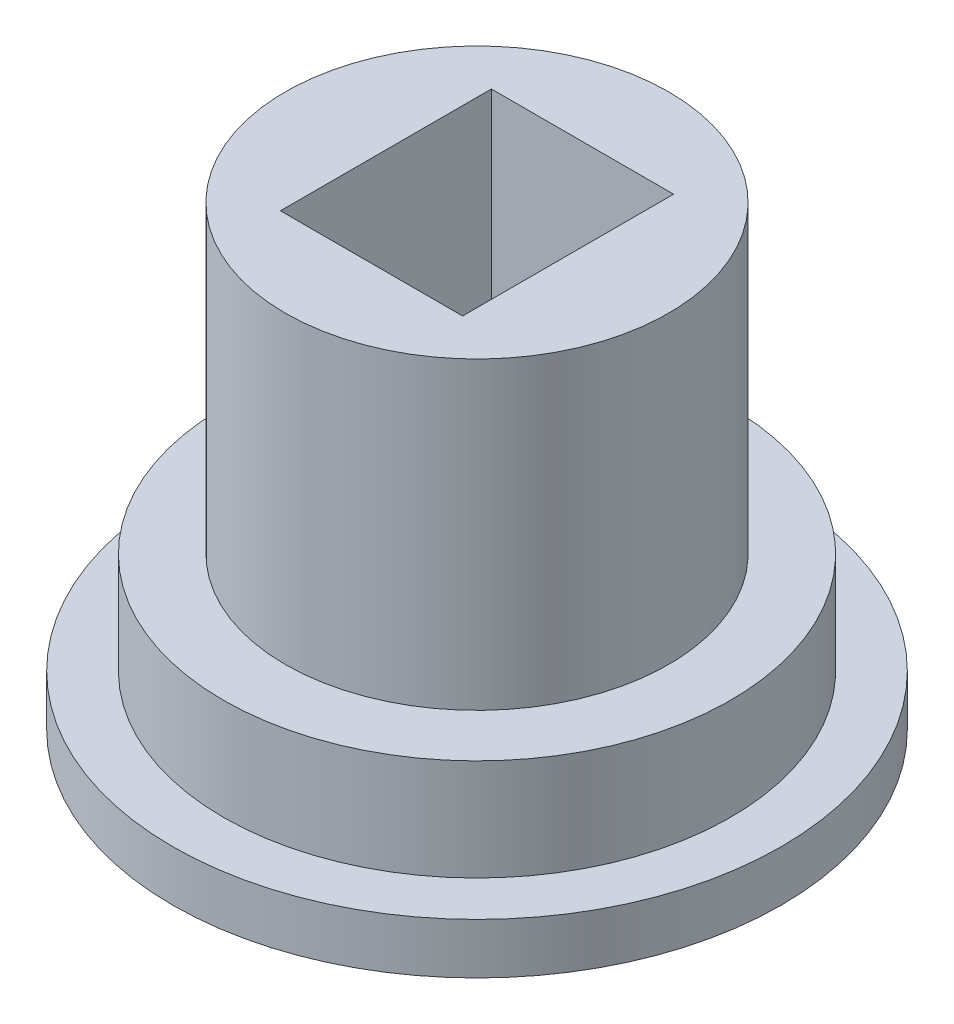
ISO-10303-21;
HEADER;
FILE_DESCRIPTION(('STEP AP214'),'2;1');
FILE_NAME('part.step','',(''),(''),'','','');
FILE_SCHEMA(('AUTOMOTIVE_DESIGN { 1 0 10303 214 1 1 1 1 }'));
ENDSEC;
DATA;
#1=APPLICATION_CONTEXT('core data for automotive mechanical design processes');
#2=APPLICATION_PROTOCOL_DEFINITION('international standard','automotive_design',2000,#1);
#3=PRODUCT_CONTEXT('',#1,'mechanical');
#4=PRODUCT('Part','Part','',(#3));
#5=PRODUCT_RELATED_PRODUCT_CATEGORY('part','',(#4));
#6=PRODUCT_DEFINITION_FORMATION('','',#4);
#7=PRODUCT_DEFINITION_CONTEXT('part definition',#1,'design');
#8=PRODUCT_DEFINITION('design','',#6,#7);
#9=PRODUCT_DEFINITION_SHAPE('','',#8);
#10=(LENGTH_UNIT() NAMED_UNIT(*) SI_UNIT(.MILLI.,.METRE.));
#11=(NAMED_UNIT(*) PLANE_ANGLE_UNIT() SI_UNIT($,.RADIAN.));
#12=(NAMED_UNIT(*) SI_UNIT($,.STERADIAN.) SOLID_ANGLE_UNIT());
#13=UNCERTAINTY_MEASURE_WITH_UNIT(LENGTH_MEASURE(1.E-05),#10,'distance_accuracy_value','');
#14=(GEOMETRIC_REPRESENTATION_CONTEXT(3) GLOBAL_UNCERTAINTY_ASSIGNED_CONTEXT((#13)) GLOBAL_UNIT_ASSIGNED_CONTEXT((#10,
#11,#12)) REPRESENTATION_CONTEXT('',''));
#15=CARTESIAN_POINT('',(0.,0.,0.));
#16=DIRECTION('',(0.,0.,1.));
#17=DIRECTION('',(1.,0.,0.));
#18=AXIS2_PLACEMENT_3D('',#15,#16,#17);
#19=CARTESIAN_POINT('',(0.,2.54,0.));
#20=DIRECTION('',(0.,-1.,0.));
#21=DIRECTION('',(0.,0.,-1.));
#22=AXIS2_PLACEMENT_3D('',#19,#20,#21);
#23=CYLINDRICAL_SURFACE('',#22,6.35);
#24=CARTESIAN_POINT('',(0.,2.54,0.));
#25=DIRECTION('',(0.,1.,0.));
#26=DIRECTION('',(0.,0.,1.));
#27=AXIS2_PLACEMENT_3D('',#24,#25,#26);
#28=CIRCLE('',#27,6.35);
#29=CARTESIAN_POINT('',(0.,2.54,6.35));
#30=VERTEX_POINT('',#29);
#31=EDGE_CURVE('E44',#30,#30,#28,.T.);
#32=ORIENTED_EDGE('',*,*,#31,.F.);
#33=EDGE_LOOP('',(#32));
#34=FACE_BOUND('',#33,.T.);
#35=CARTESIAN_POINT('',(0.,0.,0.));
#36=DIRECTION('',(0.,1.,0.));
#37=DIRECTION('',(0.,0.,1.));
#38=AXIS2_PLACEMENT_3D('',#35,#36,#37);
#39=CIRCLE('',#38,6.35);
#40=CARTESIAN_POINT('',(0.,0.,6.35));
#41=VERTEX_POINT('',#40);
#42=EDGE_CURVE('E39',#41,#41,#39,.T.);
#43=ORIENTED_EDGE('',*,*,#42,.T.);
#44=EDGE_LOOP('',(#43));
#45=FACE_BOUND('',#44,.T.);
#46=ADVANCED_FACE('F36',(#34,#45),#23,.T.);
#47=CARTESIAN_POINT('',(0.,2.54,0.));
#48=DIRECTION('',(0.,1.,0.));
#49=DIRECTION('',(0.,0.,1.));
#50=AXIS2_PLACEMENT_3D('',#47,#48,#49);
#51=PLANE('',#50);
#52=CARTESIAN_POINT('',(0.,2.54,0.));
#53=DIRECTION('',(0.,1.,0.));
#54=DIRECTION('',(0.,0.,1.));
#55=AXIS2_PLACEMENT_3D('',#52,#53,#54);
#56=CIRCLE('',#55,4.8006);
#57=CARTESIAN_POINT('',(0.,2.54,4.8006));
#58=VERTEX_POINT('',#57);
#59=EDGE_CURVE('E11',#58,#58,#56,.T.);
#60=ORIENTED_EDGE('',*,*,#59,.F.);
#61=EDGE_LOOP('',(#60));
#62=FACE_BOUND('',#61,.T.);
#63=ORIENTED_EDGE('',*,*,#31,.T.);
#64=EDGE_LOOP('',(#63));
#65=FACE_BOUND('',#64,.T.);
#66=ADVANCED_FACE('F121',(#62,#65),#51,.T.);
#67=CARTESIAN_POINT('',(0.,10.16,0.));
#68=DIRECTION('',(0.,-1.,0.));
#69=DIRECTION('',(0.,0.,-1.));
#70=AXIS2_PLACEMENT_3D('',#67,#68,#69);
#71=CYLINDRICAL_SURFACE('',#70,4.8006);
#72=CARTESIAN_POINT('',(0.,10.16,0.));
#73=DIRECTION('',(0.,1.,0.));
#74=DIRECTION('',(0.,0.,1.));
#75=AXIS2_PLACEMENT_3D('',#72,#73,#74);
#76=CIRCLE('',#75,4.8006);
#77=CARTESIAN_POINT('',(0.,10.16,4.8006));
#78=VERTEX_POINT('',#77);
#79=EDGE_CURVE('E114',#78,#78,#76,.T.);
#80=ORIENTED_EDGE('',*,*,#79,.F.);
#81=EDGE_LOOP('',(#80));
#82=FACE_BOUND('',#81,.T.);
#83=ORIENTED_EDGE('',*,*,#59,.T.);
#84=EDGE_LOOP('',(#83));
#85=FACE_BOUND('',#84,.T.);
#86=ADVANCED_FACE('F193',(#82,#85),#71,.T.);
#87=CARTESIAN_POINT('',(0.,10.16,0.));
#88=DIRECTION('',(0.,1.,0.));
#89=DIRECTION('',(0.,0.,1.));
#90=AXIS2_PLACEMENT_3D('',#87,#88,#89);
#91=PLANE('',#90);
#92=DIRECTION('',(0.,0.,-1.));
#93=VECTOR('',#92,1.);
#94=CARTESIAN_POINT('',(2.28138181818181,10.16,2.6416));
#95=LINE('',#94,#93);
#96=CARTESIAN_POINT('',(2.28138181818181,10.16,2.6416));
#97=VERTEX_POINT('',#96);
#98=CARTESIAN_POINT('',(2.28138181818181,10.16,-2.6416));
#99=VERTEX_POINT('',#98);
#100=EDGE_CURVE('E52',#97,#99,#95,.T.);
#101=ORIENTED_EDGE('',*,*,#100,.F.);
#102=DIRECTION('',(1.,0.,0.));
#103=VECTOR('',#102,1.);
#104=CARTESIAN_POINT('',(-2.28138181818181,10.16,2.6416));
#105=LINE('',#104,#103);
#106=CARTESIAN_POINT('',(-2.28138181818181,10.16,2.6416));
#107=VERTEX_POINT('',#106);
#108=EDGE_CURVE('E103',#107,#97,#105,.T.);
#109=ORIENTED_EDGE('',*,*,#108,.F.);
#110=DIRECTION('',(0.,0.,1.));
#111=VECTOR('',#110,1.);
#112=CARTESIAN_POINT('',(-2.28138181818181,10.16,2.6416));
#113=LINE('',#112,#111);
#114=CARTESIAN_POINT('',(-2.28138181818181,10.16,-2.6416));
#115=VERTEX_POINT('',#114);
#116=EDGE_CURVE('E110',#115,#107,#113,.T.);
#117=ORIENTED_EDGE('',*,*,#116,.F.);
#118=DIRECTION('',(-1.,0.,0.));
#119=VECTOR('',#118,1.);
#120=CARTESIAN_POINT('',(-2.28138181818181,10.16,-2.6416));
#121=LINE('',#120,#119);
#122=EDGE_CURVE('E87',#99,#115,#121,.T.);
#123=ORIENTED_EDGE('',*,*,#122,.F.);
#124=EDGE_LOOP('',(#101,#109,#117,#123));
#125=FACE_BOUND('',#124,.T.);
#126=ORIENTED_EDGE('',*,*,#79,.T.);
#127=EDGE_LOOP('',(#126));
#128=FACE_BOUND('',#127,.T.);
#129=ADVANCED_FACE('F190',(#125,#128),#91,.T.);
#130=CARTESIAN_POINT('',(2.28138181818181,2.54,2.6416));
#131=DIRECTION('',(1.,0.,0.));
#132=DIRECTION('',(0.,0.,-1.));
#133=AXIS2_PLACEMENT_3D('',#130,#131,#132);
#134=PLANE('',#133);
#135=ORIENTED_EDGE('',*,*,#100,.T.);
#136=DIRECTION('',(0.,1.,0.));
#137=VECTOR('',#136,1.);
#138=CARTESIAN_POINT('',(2.28138181818181,2.54,-2.6416));
#139=LINE('',#138,#137);
#140=CARTESIAN_POINT('',(2.28138181818181,2.54,-2.6416));
#141=VERTEX_POINT('',#140);
#142=EDGE_CURVE('E75',#141,#99,#139,.T.);
#143=ORIENTED_EDGE('',*,*,#142,.F.);
#144=DIRECTION('',(0.,0.,-1.));
#145=VECTOR('',#144,1.);
#146=CARTESIAN_POINT('',(2.28138181818181,2.54,2.6416));
#147=LINE('',#146,#145);
#148=CARTESIAN_POINT('',(2.28138181818181,2.54,2.6416));
#149=VERTEX_POINT('',#148);
#150=EDGE_CURVE('E101',#149,#141,#147,.T.);
#151=ORIENTED_EDGE('',*,*,#150,.F.);
#152=DIRECTION('',(0.,1.,0.));
#153=VECTOR('',#152,1.);
#154=CARTESIAN_POINT('',(2.28138181818181,2.54,2.6416));
#155=LINE('',#154,#153);
#156=EDGE_CURVE('E60',#149,#97,#155,.T.);
#157=ORIENTED_EDGE('',*,*,#156,.T.);
#158=EDGE_LOOP('',(#135,#143,#151,#157));
#159=FACE_BOUND('',#158,.T.);
#160=ADVANCED_FACE('F183',(#159),#134,.F.);
#161=CARTESIAN_POINT('',(-2.28138181818181,2.54,2.6416));
#162=DIRECTION('',(0.,0.,1.));
#163=DIRECTION('',(1.,0.,0.));
#164=AXIS2_PLACEMENT_3D('',#161,#162,#163);
#165=PLANE('',#164);
#166=ORIENTED_EDGE('',*,*,#108,.T.);
#167=ORIENTED_EDGE('',*,*,#156,.F.);
#168=DIRECTION('',(1.,0.,0.));
#169=VECTOR('',#168,1.);
#170=CARTESIAN_POINT('',(-2.28138181818181,2.54,2.6416));
#171=LINE('',#170,#169);
#172=CARTESIAN_POINT('',(-2.28138181818181,2.54,2.6416));
#173=VERTEX_POINT('',#172);
#174=EDGE_CURVE('E98',#173,#149,#171,.T.);
#175=ORIENTED_EDGE('',*,*,#174,.F.);
#176=DIRECTION('',(0.,1.,0.));
#177=VECTOR('',#176,1.);
#178=CARTESIAN_POINT('',(-2.28138181818181,2.54,2.6416));
#179=LINE('',#178,#177);
#180=EDGE_CURVE('E91',#173,#107,#179,.T.);
#181=ORIENTED_EDGE('',*,*,#180,.T.);
#182=EDGE_LOOP('',(#166,#167,#175,#181));
#183=FACE_BOUND('',#182,.T.);
#184=ADVANCED_FACE('F180',(#183),#165,.F.);
#185=CARTESIAN_POINT('',(-2.28138181818181,2.54,2.6416));
#186=DIRECTION('',(-1.,0.,0.));
#187=DIRECTION('',(0.,0.,1.));
#188=AXIS2_PLACEMENT_3D('',#185,#186,#187);
#189=PLANE('',#188);
#190=ORIENTED_EDGE('',*,*,#116,.T.);
#191=ORIENTED_EDGE('',*,*,#180,.F.);
#192=DIRECTION('',(0.,0.,1.));
#193=VECTOR('',#192,1.);
#194=CARTESIAN_POINT('',(-2.28138181818181,2.54,2.6416));
#195=LINE('',#194,#193);
#196=CARTESIAN_POINT('',(-2.28138181818181,2.54,-2.6416));
#197=VERTEX_POINT('',#196);
#198=EDGE_CURVE('E94',#197,#173,#195,.T.);
#199=ORIENTED_EDGE('',*,*,#198,.F.);
#200=DIRECTION('',(0.,1.,0.));
#201=VECTOR('',#200,1.);
#202=CARTESIAN_POINT('',(-2.28138181818181,2.54,-2.6416));
#203=LINE('',#202,#201);
#204=EDGE_CURVE('E80',#197,#115,#203,.T.);
#205=ORIENTED_EDGE('',*,*,#204,.T.);
#206=EDGE_LOOP('',(#190,#191,#199,#205));
#207=FACE_BOUND('',#206,.T.);
#208=ADVANCED_FACE('F95',(#207),#189,.F.);
#209=CARTESIAN_POINT('',(-2.28138181818181,2.54,-2.6416));
#210=DIRECTION('',(0.,0.,-1.));
#211=DIRECTION('',(-1.,0.,0.));
#212=AXIS2_PLACEMENT_3D('',#209,#210,#211);
#213=PLANE('',#212);
#214=ORIENTED_EDGE('',*,*,#122,.T.);
#215=ORIENTED_EDGE('',*,*,#204,.F.);
#216=DIRECTION('',(-1.,0.,0.));
#217=VECTOR('',#216,1.);
#218=CARTESIAN_POINT('',(-2.28138181818181,2.54,-2.6416));
#219=LINE('',#218,#217);
#220=EDGE_CURVE('E84',#141,#197,#219,.T.);
#221=ORIENTED_EDGE('',*,*,#220,.F.);
#222=ORIENTED_EDGE('',*,*,#142,.T.);
#223=EDGE_LOOP('',(#214,#215,#221,#222));
#224=FACE_BOUND('',#223,.T.);
#225=ADVANCED_FACE('F82',(#224),#213,.F.);
#226=CARTESIAN_POINT('',(0.,2.54,0.));
#227=DIRECTION('',(0.,-1.,0.));
#228=DIRECTION('',(0.,0.,-1.));
#229=AXIS2_PLACEMENT_3D('',#226,#227,#228);
#230=PLANE('',#229);
#231=CARTESIAN_POINT('',(0.,2.54,-1.27));
#232=DIRECTION('',(0.,1.,0.));
#233=DIRECTION('',(0.,0.,1.));
#234=AXIS2_PLACEMENT_3D('',#231,#232,#233);
#235=CIRCLE('',#234,0.762);
#236=CARTESIAN_POINT('',(0.,2.54,-0.508));
#237=VERTEX_POINT('',#236);
#238=EDGE_CURVE('E143',#237,#237,#235,.T.);
#239=ORIENTED_EDGE('',*,*,#238,.F.);
#240=EDGE_LOOP('',(#239));
#241=FACE_BOUND('',#240,.T.);
#242=CARTESIAN_POINT('',(0.,2.54,1.27));
#243=DIRECTION('',(0.,1.,0.));
#244=DIRECTION('',(0.,0.,1.));
#245=AXIS2_PLACEMENT_3D('',#242,#243,#244);
#246=CIRCLE('',#245,0.762);
#247=CARTESIAN_POINT('',(0.,2.54,2.032));
#248=VERTEX_POINT('',#247);
#249=EDGE_CURVE('E137',#248,#248,#246,.T.);
#250=ORIENTED_EDGE('',*,*,#249,.F.);
#251=EDGE_LOOP('',(#250));
#252=FACE_BOUND('',#251,.T.);
#253=ORIENTED_EDGE('',*,*,#150,.T.);
#254=ORIENTED_EDGE('',*,*,#220,.T.);
#255=ORIENTED_EDGE('',*,*,#198,.T.);
#256=ORIENTED_EDGE('',*,*,#174,.T.);
#257=EDGE_LOOP('',(#253,#254,#255,#256));
#258=FACE_BOUND('',#257,.T.);
#259=ADVANCED_FACE('F100',(#241,#252,#258),#230,.F.);
#260=CARTESIAN_POINT('',(0.,-1.27,0.));
#261=DIRECTION('',(0.,1.,0.));
#262=DIRECTION('',(0.,0.,1.));
#263=AXIS2_PLACEMENT_3D('',#260,#261,#262);
#264=CYLINDRICAL_SURFACE('',#263,7.62);
#265=CARTESIAN_POINT('',(0.,-1.27,0.));
#266=DIRECTION('',(0.,-1.,0.));
#267=DIRECTION('',(0.,0.,-1.));
#268=AXIS2_PLACEMENT_3D('',#265,#266,#267);
#269=CIRCLE('',#268,7.62);
#270=CARTESIAN_POINT('',(0.,-1.27,-7.62));
#271=VERTEX_POINT('',#270);
#272=EDGE_CURVE('E128',#271,#271,#269,.T.);
#273=ORIENTED_EDGE('',*,*,#272,.F.);
#274=EDGE_LOOP('',(#273));
#275=FACE_BOUND('',#274,.T.);
#276=CARTESIAN_POINT('',(0.,0.,0.));
#277=DIRECTION('',(0.,-1.,0.));
#278=DIRECTION('',(0.,0.,-1.));
#279=AXIS2_PLACEMENT_3D('',#276,#277,#278);
#280=CIRCLE('',#279,7.62);
#281=CARTESIAN_POINT('',(0.,0.,-7.62));
#282=VERTEX_POINT('',#281);
#283=EDGE_CURVE('E130',#282,#282,#280,.T.);
#284=ORIENTED_EDGE('',*,*,#283,.T.);
#285=EDGE_LOOP('',(#284));
#286=FACE_BOUND('',#285,.T.);
#287=ADVANCED_FACE('F161',(#275,#286),#264,.T.);
#288=CARTESIAN_POINT('',(0.,-1.27,0.));
#289=DIRECTION('',(0.,-1.,0.));
#290=DIRECTION('',(0.,0.,-1.));
#291=AXIS2_PLACEMENT_3D('',#288,#289,#290);
#292=PLANE('',#291);
#293=CARTESIAN_POINT('',(0.,-1.27,-1.27));
#294=DIRECTION('',(0.,1.,0.));
#295=DIRECTION('',(0.,0.,1.));
#296=AXIS2_PLACEMENT_3D('',#293,#294,#295);
#297=CIRCLE('',#296,0.762);
#298=CARTESIAN_POINT('',(0.,-1.27,-0.508));
#299=VERTEX_POINT('',#298);
#300=EDGE_CURVE('E140',#299,#299,#297,.T.);
#301=ORIENTED_EDGE('',*,*,#300,.T.);
#302=EDGE_LOOP('',(#301));
#303=FACE_BOUND('',#302,.T.);
#304=CARTESIAN_POINT('',(0.,-1.27,1.27));
#305=DIRECTION('',(0.,1.,0.));
#306=DIRECTION('',(0.,0.,1.));
#307=AXIS2_PLACEMENT_3D('',#304,#305,#306);
#308=CIRCLE('',#307,0.762);
#309=CARTESIAN_POINT('',(0.,-1.27,2.032));
#310=VERTEX_POINT('',#309);
#311=EDGE_CURVE('E135',#310,#310,#308,.T.);
#312=ORIENTED_EDGE('',*,*,#311,.T.);
#313=EDGE_LOOP('',(#312));
#314=FACE_BOUND('',#313,.T.);
#315=ORIENTED_EDGE('',*,*,#272,.T.);
#316=EDGE_LOOP('',(#315));
#317=FACE_BOUND('',#316,.T.);
#318=ADVANCED_FACE('F149',(#303,#314,#317),#292,.T.);
#319=CARTESIAN_POINT('',(0.,0.,0.));
#320=DIRECTION('',(0.,-1.,0.));
#321=DIRECTION('',(0.,0.,-1.));
#322=AXIS2_PLACEMENT_3D('',#319,#320,#321);
#323=PLANE('',#322);
#324=ORIENTED_EDGE('',*,*,#42,.F.);
#325=EDGE_LOOP('',(#324));
#326=FACE_BOUND('',#325,.T.);
#327=ORIENTED_EDGE('',*,*,#283,.F.);
#328=EDGE_LOOP('',(#327));
#329=FACE_BOUND('',#328,.T.);
#330=ADVANCED_FACE('F166',(#326,#329),#323,.F.);
#331=CARTESIAN_POINT('',(0.,-1.27,1.27));
#332=DIRECTION('',(0.,1.,0.));
#333=DIRECTION('',(0.,0.,1.));
#334=AXIS2_PLACEMENT_3D('',#331,#332,#333);
#335=CYLINDRICAL_SURFACE('',#334,0.762);
#336=ORIENTED_EDGE('',*,*,#311,.F.);
#337=EDGE_LOOP('',(#336));
#338=FACE_BOUND('',#337,.T.);
#339=ORIENTED_EDGE('',*,*,#249,.T.);
#340=EDGE_LOOP('',(#339));
#341=FACE_BOUND('',#340,.T.);
#342=ADVANCED_FACE('F155',(#338,#341),#335,.F.);
#343=CARTESIAN_POINT('',(0.,-1.27,-1.27));
#344=DIRECTION('',(0.,1.,0.));
#345=DIRECTION('',(0.,0.,1.));
#346=AXIS2_PLACEMENT_3D('',#343,#344,#345);
#347=CYLINDRICAL_SURFACE('',#346,0.762);
#348=ORIENTED_EDGE('',*,*,#300,.F.);
#349=EDGE_LOOP('',(#348));
#350=FACE_BOUND('',#349,.T.);
#351=ORIENTED_EDGE('',*,*,#238,.T.);
#352=EDGE_LOOP('',(#351));
#353=FACE_BOUND('',#352,.T.);
#354=ADVANCED_FACE('F152',(#350,#353),#347,.F.);
#355=CLOSED_SHELL('',(#46,#66,#86,#129,#160,#184,#208,#225,#259,#287,#318,#330,#342,#354));
#356=MANIFOLD_SOLID_BREP('B2',#355);
#357=ADVANCED_BREP_SHAPE_REPRESENTATION('',(#18,#356),#14);
#358=SHAPE_DEFINITION_REPRESENTATION(#9,#357);
ENDSEC;
END-ISO-10303-21;
